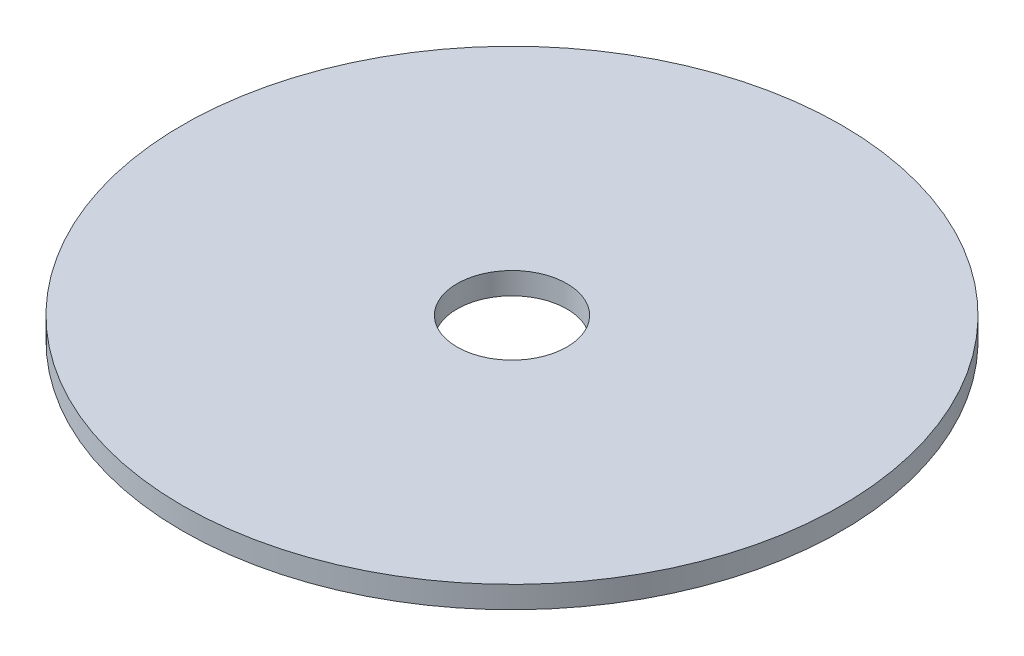
ISO-10303-21;
HEADER;
FILE_DESCRIPTION(('STEP AP214'),'2;1');
FILE_NAME('part.step','',(''),(''),'','','');
FILE_SCHEMA(('AUTOMOTIVE_DESIGN { 1 0 10303 214 1 1 1 1 }'));
ENDSEC;
DATA;
#1=APPLICATION_CONTEXT('core data for automotive mechanical design processes');
#2=APPLICATION_PROTOCOL_DEFINITION('international standard','automotive_design',2000,#1);
#3=PRODUCT_CONTEXT('',#1,'mechanical');
#4=PRODUCT('Part','Part','',(#3));
#5=PRODUCT_RELATED_PRODUCT_CATEGORY('part','',(#4));
#6=PRODUCT_DEFINITION_FORMATION('','',#4);
#7=PRODUCT_DEFINITION_CONTEXT('part definition',#1,'design');
#8=PRODUCT_DEFINITION('design','',#6,#7);
#9=PRODUCT_DEFINITION_SHAPE('','',#8);
#10=(LENGTH_UNIT() NAMED_UNIT(*) SI_UNIT(.MILLI.,.METRE.));
#11=(NAMED_UNIT(*) PLANE_ANGLE_UNIT() SI_UNIT($,.RADIAN.));
#12=(NAMED_UNIT(*) SI_UNIT($,.STERADIAN.) SOLID_ANGLE_UNIT());
#13=UNCERTAINTY_MEASURE_WITH_UNIT(LENGTH_MEASURE(1.E-05),#10,'distance_accuracy_value','');
#14=(GEOMETRIC_REPRESENTATION_CONTEXT(3) GLOBAL_UNCERTAINTY_ASSIGNED_CONTEXT((#13)) GLOBAL_UNIT_ASSIGNED_CONTEXT((#10,
#11,#12)) REPRESENTATION_CONTEXT('',''));
#15=CARTESIAN_POINT('',(0.,0.,0.));
#16=DIRECTION('',(0.,0.,1.));
#17=DIRECTION('',(1.,0.,0.));
#18=AXIS2_PLACEMENT_3D('',#15,#16,#17);
#19=CARTESIAN_POINT('',(0.,4.,0.));
#20=DIRECTION('',(0.,-1.,0.));
#21=DIRECTION('',(0.,0.,-1.));
#22=AXIS2_PLACEMENT_3D('',#19,#20,#21);
#23=CYLINDRICAL_SURFACE('',#22,60.);
#24=CARTESIAN_POINT('',(0.,4.,0.));
#25=DIRECTION('',(0.,1.,0.));
#26=DIRECTION('',(0.,0.,1.));
#27=AXIS2_PLACEMENT_3D('',#24,#25,#26);
#28=CIRCLE('',#27,60.);
#29=CARTESIAN_POINT('',(0.,4.,60.));
#30=VERTEX_POINT('',#29);
#31=EDGE_CURVE('E10',#30,#30,#28,.T.);
#32=ORIENTED_EDGE('',*,*,#31,.F.);
#33=EDGE_LOOP('',(#32));
#34=FACE_BOUND('',#33,.T.);
#35=CARTESIAN_POINT('',(0.,0.,0.));
#36=DIRECTION('',(0.,1.,0.));
#37=DIRECTION('',(0.,0.,1.));
#38=AXIS2_PLACEMENT_3D('',#35,#36,#37);
#39=CIRCLE('',#38,60.);
#40=CARTESIAN_POINT('',(0.,0.,60.));
#41=VERTEX_POINT('',#40);
#42=EDGE_CURVE('E41',#41,#41,#39,.T.);
#43=ORIENTED_EDGE('',*,*,#42,.T.);
#44=EDGE_LOOP('',(#43));
#45=FACE_BOUND('',#44,.T.);
#46=ADVANCED_FACE('F34',(#34,#45),#23,.T.);
#47=CARTESIAN_POINT('',(0.,4.,0.));
#48=DIRECTION('',(0.,1.,0.));
#49=DIRECTION('',(0.,0.,1.));
#50=AXIS2_PLACEMENT_3D('',#47,#48,#49);
#51=PLANE('',#50);
#52=CARTESIAN_POINT('',(0.,4.,0.));
#53=DIRECTION('',(0.,1.,0.));
#54=DIRECTION('',(0.,0.,1.));
#55=AXIS2_PLACEMENT_3D('',#52,#53,#54);
#56=CIRCLE('',#55,10.);
#57=CARTESIAN_POINT('',(0.,4.,10.));
#58=VERTEX_POINT('',#57);
#59=EDGE_CURVE('E47',#58,#58,#56,.T.);
#60=ORIENTED_EDGE('',*,*,#59,.F.);
#61=EDGE_LOOP('',(#60));
#62=FACE_BOUND('',#61,.T.);
#63=ORIENTED_EDGE('',*,*,#31,.T.);
#64=EDGE_LOOP('',(#63));
#65=FACE_BOUND('',#64,.T.);
#66=ADVANCED_FACE('F63',(#62,#65),#51,.T.);
#67=CARTESIAN_POINT('',(0.,0.,0.));
#68=DIRECTION('',(0.,1.,0.));
#69=DIRECTION('',(0.,0.,1.));
#70=AXIS2_PLACEMENT_3D('',#67,#68,#69);
#71=PLANE('',#70);
#72=CARTESIAN_POINT('',(0.,0.,0.));
#73=DIRECTION('',(0.,1.,0.));
#74=DIRECTION('',(0.,0.,1.));
#75=AXIS2_PLACEMENT_3D('',#72,#73,#74);
#76=CIRCLE('',#75,10.);
#77=CARTESIAN_POINT('',(0.,0.,10.));
#78=VERTEX_POINT('',#77);
#79=EDGE_CURVE('E37',#78,#78,#76,.T.);
#80=ORIENTED_EDGE('',*,*,#79,.T.);
#81=EDGE_LOOP('',(#80));
#82=FACE_BOUND('',#81,.T.);
#83=ORIENTED_EDGE('',*,*,#42,.F.);
#84=EDGE_LOOP('',(#83));
#85=FACE_BOUND('',#84,.T.);
#86=ADVANCED_FACE('F54',(#82,#85),#71,.F.);
#87=CARTESIAN_POINT('',(0.,-6.,0.));
#88=DIRECTION('',(0.,1.,0.));
#89=DIRECTION('',(0.,0.,1.));
#90=AXIS2_PLACEMENT_3D('',#87,#88,#89);
#91=CYLINDRICAL_SURFACE('',#90,10.);
#92=ORIENTED_EDGE('',*,*,#59,.T.);
#93=EDGE_LOOP('',(#92));
#94=FACE_BOUND('',#93,.T.);
#95=ORIENTED_EDGE('',*,*,#79,.F.);
#96=EDGE_LOOP('',(#95));
#97=FACE_BOUND('',#96,.T.);
#98=ADVANCED_FACE('F57',(#94,#97),#91,.F.);
#99=CLOSED_SHELL('',(#46,#66,#86,#98));
#100=MANIFOLD_SOLID_BREP('B2',#99);
#101=ADVANCED_BREP_SHAPE_REPRESENTATION('',(#18,#100),#14);
#102=SHAPE_DEFINITION_REPRESENTATION(#9,#101);
ENDSEC;
END-ISO-10303-21;
